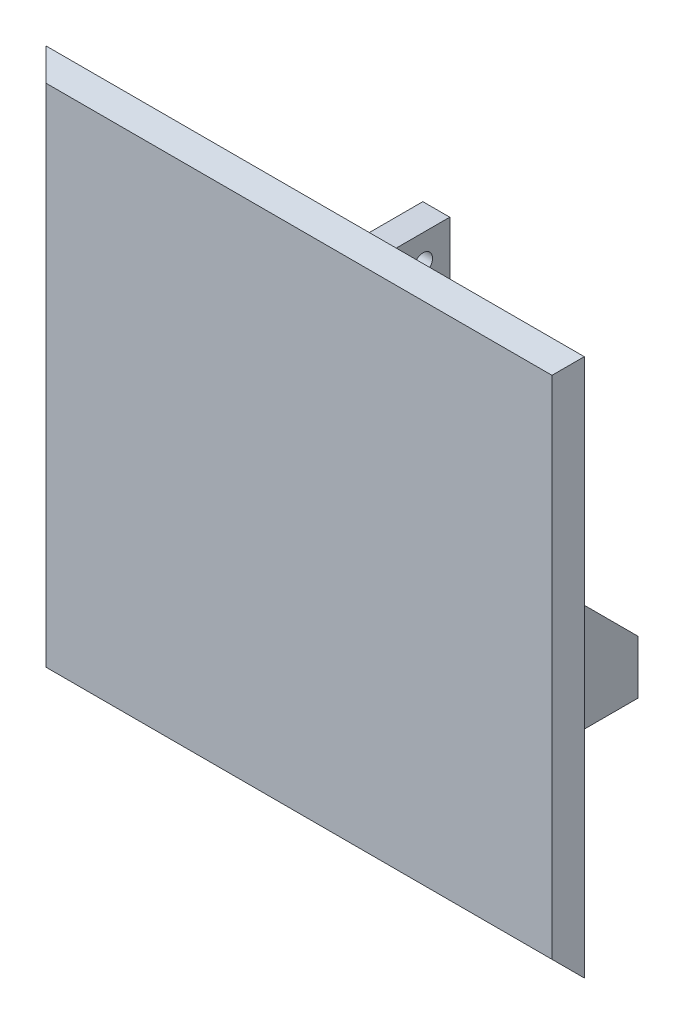
ISO-10303-21;
HEADER;
FILE_DESCRIPTION(('STEP AP214'),'2;1');
FILE_NAME('part.step','',(''),(''),'','','');
FILE_SCHEMA(('AUTOMOTIVE_DESIGN { 1 0 10303 214 1 1 1 1 }'));
ENDSEC;
DATA;
#1=APPLICATION_CONTEXT('core data for automotive mechanical design processes');
#2=APPLICATION_PROTOCOL_DEFINITION('international standard','automotive_design',2000,#1);
#3=PRODUCT_CONTEXT('',#1,'mechanical');
#4=PRODUCT('Part','Part','',(#3));
#5=PRODUCT_RELATED_PRODUCT_CATEGORY('part','',(#4));
#6=PRODUCT_DEFINITION_FORMATION('','',#4);
#7=PRODUCT_DEFINITION_CONTEXT('part definition',#1,'design');
#8=PRODUCT_DEFINITION('design','',#6,#7);
#9=PRODUCT_DEFINITION_SHAPE('','',#8);
#10=(LENGTH_UNIT() NAMED_UNIT(*) SI_UNIT(.MILLI.,.METRE.));
#11=(NAMED_UNIT(*) PLANE_ANGLE_UNIT() SI_UNIT($,.RADIAN.));
#12=(NAMED_UNIT(*) SI_UNIT($,.STERADIAN.) SOLID_ANGLE_UNIT());
#13=UNCERTAINTY_MEASURE_WITH_UNIT(LENGTH_MEASURE(1.E-05),#10,'distance_accuracy_value','');
#14=(GEOMETRIC_REPRESENTATION_CONTEXT(3) GLOBAL_UNCERTAINTY_ASSIGNED_CONTEXT((#13)) GLOBAL_UNIT_ASSIGNED_CONTEXT((#10,
#11,#12)) REPRESENTATION_CONTEXT('',''));
#15=CARTESIAN_POINT('',(0.,0.,0.));
#16=DIRECTION('',(0.,0.,1.));
#17=DIRECTION('',(1.,0.,0.));
#18=AXIS2_PLACEMENT_3D('',#15,#16,#17);
#19=CARTESIAN_POINT('',(0.,0.,3.));
#20=DIRECTION('',(0.,0.,-1.));
#21=DIRECTION('',(1.,0.,0.));
#22=AXIS2_PLACEMENT_3D('',#19,#20,#21);
#23=PLANE('',#22);
#24=DIRECTION('',(1.,0.,0.));
#25=VECTOR('',#24,1.);
#26=CARTESIAN_POINT('',(89.95,40.,3.));
#27=LINE('',#26,#25);
#28=CARTESIAN_POINT('',(89.95,40.,3.));
#29=VERTEX_POINT('',#28);
#30=CARTESIAN_POINT('',(99.95,40.,3.));
#31=VERTEX_POINT('',#30);
#32=EDGE_CURVE('E216',#29,#31,#27,.T.);
#33=ORIENTED_EDGE('',*,*,#32,.T.);
#34=DIRECTION('',(0.,1.,0.));
#35=VECTOR('',#34,1.);
#36=CARTESIAN_POINT('',(99.95,60.,3.));
#37=LINE('',#36,#35);
#38=CARTESIAN_POINT('',(99.95,60.,3.));
#39=VERTEX_POINT('',#38);
#40=EDGE_CURVE('E219',#31,#39,#37,.T.);
#41=ORIENTED_EDGE('',*,*,#40,.T.);
#42=DIRECTION('',(-1.,0.,0.));
#43=VECTOR('',#42,1.);
#44=CARTESIAN_POINT('',(89.95,60.,3.));
#45=LINE('',#44,#43);
#46=CARTESIAN_POINT('',(89.95,60.,3.));
#47=VERTEX_POINT('',#46);
#48=EDGE_CURVE('E206',#39,#47,#45,.T.);
#49=ORIENTED_EDGE('',*,*,#48,.T.);
#50=DIRECTION('',(0.,-1.,0.));
#51=VECTOR('',#50,1.);
#52=CARTESIAN_POINT('',(89.95,60.,3.));
#53=LINE('',#52,#51);
#54=EDGE_CURVE('E213',#47,#29,#53,.T.);
#55=ORIENTED_EDGE('',*,*,#54,.T.);
#56=EDGE_LOOP('',(#33,#41,#49,#55));
#57=FACE_BOUND('',#56,.T.);
#58=DIRECTION('',(0.,-1.,0.));
#59=VECTOR('',#58,1.);
#60=CARTESIAN_POINT('',(0.,100.,3.));
#61=LINE('',#60,#59);
#62=CARTESIAN_POINT('',(0.,100.,3.));
#63=VERTEX_POINT('',#62);
#64=CARTESIAN_POINT('',(0.,0.,3.));
#65=VERTEX_POINT('',#64);
#66=EDGE_CURVE('E252',#63,#65,#61,.T.);
#67=ORIENTED_EDGE('',*,*,#66,.F.);
#68=DIRECTION('',(-1.,0.,0.));
#69=VECTOR('',#68,1.);
#70=CARTESIAN_POINT('',(0.,100.,3.));
#71=LINE('',#70,#69);
#72=CARTESIAN_POINT('',(100.,100.,3.));
#73=VERTEX_POINT('',#72);
#74=EDGE_CURVE('E260',#73,#63,#71,.T.);
#75=ORIENTED_EDGE('',*,*,#74,.F.);
#76=DIRECTION('',(0.,1.,0.));
#77=VECTOR('',#76,1.);
#78=CARTESIAN_POINT('',(100.,100.,3.));
#79=LINE('',#78,#77);
#80=CARTESIAN_POINT('',(100.,0.,3.));
#81=VERTEX_POINT('',#80);
#82=EDGE_CURVE('E257',#81,#73,#79,.T.);
#83=ORIENTED_EDGE('',*,*,#82,.F.);
#84=DIRECTION('',(1.,0.,0.));
#85=VECTOR('',#84,1.);
#86=CARTESIAN_POINT('',(0.,0.,3.));
#87=LINE('',#86,#85);
#88=EDGE_CURVE('E255',#65,#81,#87,.T.);
#89=ORIENTED_EDGE('',*,*,#88,.F.);
#90=EDGE_LOOP('',(#67,#75,#83,#89));
#91=FACE_BOUND('',#90,.T.);
#92=DIRECTION('',(1.,0.,0.));
#93=VECTOR('',#92,1.);
#94=CARTESIAN_POINT('',(0.0499999999999819,40.,3.));
#95=LINE('',#94,#93);
#96=CARTESIAN_POINT('',(0.0499999999999819,40.,3.));
#97=VERTEX_POINT('',#96);
#98=CARTESIAN_POINT('',(10.05,40.,3.));
#99=VERTEX_POINT('',#98);
#100=EDGE_CURVE('E241',#97,#99,#95,.T.);
#101=ORIENTED_EDGE('',*,*,#100,.T.);
#102=DIRECTION('',(0.,1.,0.));
#103=VECTOR('',#102,1.);
#104=CARTESIAN_POINT('',(10.05,60.,3.));
#105=LINE('',#104,#103);
#106=CARTESIAN_POINT('',(10.05,60.,3.));
#107=VERTEX_POINT('',#106);
#108=EDGE_CURVE('E244',#99,#107,#105,.T.);
#109=ORIENTED_EDGE('',*,*,#108,.T.);
#110=DIRECTION('',(-1.,0.,0.));
#111=VECTOR('',#110,1.);
#112=CARTESIAN_POINT('',(0.0499999999999793,60.,3.));
#113=LINE('',#112,#111);
#114=CARTESIAN_POINT('',(0.0499999999999793,60.,3.));
#115=VERTEX_POINT('',#114);
#116=EDGE_CURVE('E232',#107,#115,#113,.T.);
#117=ORIENTED_EDGE('',*,*,#116,.T.);
#118=DIRECTION('',(0.,-1.,0.));
#119=VECTOR('',#118,1.);
#120=CARTESIAN_POINT('',(0.0499999999999793,60.,3.));
#121=LINE('',#120,#119);
#122=EDGE_CURVE('E227',#115,#97,#121,.T.);
#123=ORIENTED_EDGE('',*,*,#122,.T.);
#124=EDGE_LOOP('',(#101,#109,#117,#123));
#125=FACE_BOUND('',#124,.T.);
#126=DIRECTION('',(-1.,0.,0.));
#127=VECTOR('',#126,1.);
#128=CARTESIAN_POINT('',(65.,99.95,3.));
#129=LINE('',#128,#127);
#130=CARTESIAN_POINT('',(65.,99.95,3.));
#131=VERTEX_POINT('',#130);
#132=CARTESIAN_POINT('',(60.,99.95,3.));
#133=VERTEX_POINT('',#132);
#134=EDGE_CURVE('E166',#131,#133,#129,.T.);
#135=ORIENTED_EDGE('',*,*,#134,.T.);
#136=DIRECTION('',(0.,-1.,0.));
#137=VECTOR('',#136,1.);
#138=CARTESIAN_POINT('',(60.,99.95,3.));
#139=LINE('',#138,#137);
#140=CARTESIAN_POINT('',(60.,89.95,3.));
#141=VERTEX_POINT('',#140);
#142=EDGE_CURVE('E177',#133,#141,#139,.T.);
#143=ORIENTED_EDGE('',*,*,#142,.T.);
#144=DIRECTION('',(1.,0.,0.));
#145=VECTOR('',#144,1.);
#146=CARTESIAN_POINT('',(65.,89.95,3.));
#147=LINE('',#146,#145);
#148=CARTESIAN_POINT('',(65.,89.95,3.));
#149=VERTEX_POINT('',#148);
#150=EDGE_CURVE('E174',#141,#149,#147,.T.);
#151=ORIENTED_EDGE('',*,*,#150,.T.);
#152=DIRECTION('',(0.,1.,0.));
#153=VECTOR('',#152,1.);
#154=CARTESIAN_POINT('',(65.,99.95,3.));
#155=LINE('',#154,#153);
#156=EDGE_CURVE('E185',#149,#131,#155,.T.);
#157=ORIENTED_EDGE('',*,*,#156,.T.);
#158=EDGE_LOOP('',(#135,#143,#151,#157));
#159=FACE_BOUND('',#158,.T.);
#160=ADVANCED_FACE('F35',(#57,#91,#125,#159),#23,.T.);
#161=CARTESIAN_POINT('',(0.,0.,6.));
#162=DIRECTION('',(0.,0.,-1.));
#163=DIRECTION('',(1.,0.,0.));
#164=AXIS2_PLACEMENT_3D('',#161,#162,#163);
#165=PLANE('',#164);
#166=DIRECTION('',(0.,-1.,0.));
#167=VECTOR('',#166,1.);
#168=CARTESIAN_POINT('',(97.,0.,6.));
#169=LINE('',#168,#167);
#170=CARTESIAN_POINT('',(97.,97.,6.));
#171=VERTEX_POINT('',#170);
#172=CARTESIAN_POINT('',(97.,3.00000000000002,6.));
#173=VERTEX_POINT('',#172);
#174=EDGE_CURVE('E44',#171,#173,#169,.T.);
#175=ORIENTED_EDGE('',*,*,#174,.F.);
#176=DIRECTION('',(1.,0.,0.));
#177=VECTOR('',#176,1.);
#178=CARTESIAN_POINT('',(0.,97.,6.));
#179=LINE('',#178,#177);
#180=CARTESIAN_POINT('',(3.,97.,6.));
#181=VERTEX_POINT('',#180);
#182=EDGE_CURVE('E284',#181,#171,#179,.T.);
#183=ORIENTED_EDGE('',*,*,#182,.F.);
#184=DIRECTION('',(0.,1.,0.));
#185=VECTOR('',#184,1.);
#186=CARTESIAN_POINT('',(3.00000000000002,0.,6.));
#187=LINE('',#186,#185);
#188=CARTESIAN_POINT('',(3.00000000000002,3.00000000000002,6.));
#189=VERTEX_POINT('',#188);
#190=EDGE_CURVE('E277',#189,#181,#187,.T.);
#191=ORIENTED_EDGE('',*,*,#190,.F.);
#192=DIRECTION('',(-1.,0.,0.));
#193=VECTOR('',#192,1.);
#194=CARTESIAN_POINT('',(0.,3.00000000000002,6.));
#195=LINE('',#194,#193);
#196=EDGE_CURVE('E11',#173,#189,#195,.T.);
#197=ORIENTED_EDGE('',*,*,#196,.F.);
#198=EDGE_LOOP('',(#175,#183,#191,#197));
#199=FACE_BOUND('',#198,.T.);
#200=ADVANCED_FACE('F302',(#199),#165,.F.);
#201=CARTESIAN_POINT('',(0.0499999999999793,60.,-7.));
#202=DIRECTION('',(1.,0.,0.));
#203=DIRECTION('',(0.,1.,0.));
#204=AXIS2_PLACEMENT_3D('',#201,#202,#203);
#205=PLANE('',#204);
#206=DIRECTION('',(0.,-1.,0.));
#207=VECTOR('',#206,1.);
#208=CARTESIAN_POINT('',(0.0499999999999793,60.,-7.));
#209=LINE('',#208,#207);
#210=CARTESIAN_POINT('',(0.0499999999999806,50.,-7.));
#211=VERTEX_POINT('',#210);
#212=CARTESIAN_POINT('',(0.0499999999999819,40.,-7.));
#213=VERTEX_POINT('',#212);
#214=EDGE_CURVE('E228',#211,#213,#209,.T.);
#215=ORIENTED_EDGE('',*,*,#214,.T.);
#216=DIRECTION('',(0.,0.,1.));
#217=VECTOR('',#216,1.);
#218=CARTESIAN_POINT('',(0.0499999999999819,40.,-7.));
#219=LINE('',#218,#217);
#220=EDGE_CURVE('E250',#213,#97,#219,.T.);
#221=ORIENTED_EDGE('',*,*,#220,.T.);
#222=ORIENTED_EDGE('',*,*,#122,.F.);
#223=DIRECTION('',(0.,0.707106781186547,0.707106781186549));
#224=VECTOR('',#223,1.);
#225=CARTESIAN_POINT('',(0.0499999999999806,50.,-7.));
#226=LINE('',#225,#224);
#227=EDGE_CURVE('E272',#211,#115,#226,.T.);
#228=ORIENTED_EDGE('',*,*,#227,.F.);
#229=EDGE_LOOP('',(#215,#221,#222,#228));
#230=FACE_BOUND('',#229,.T.);
#231=ADVANCED_FACE('F326',(#230),#205,.F.);
#232=CARTESIAN_POINT('',(0.0499999999999819,40.,-7.));
#233=DIRECTION('',(0.,1.,0.));
#234=DIRECTION('',(0.,0.,-1.));
#235=AXIS2_PLACEMENT_3D('',#232,#233,#234);
#236=PLANE('',#235);
#237=CARTESIAN_POINT('',(5.04622786455411,40.,-2.));
#238=DIRECTION('',(0.,1.,0.));
#239=DIRECTION('',(0.,0.,1.));
#240=AXIS2_PLACEMENT_3D('',#237,#238,#239);
#241=CIRCLE('',#240,1.525);
#242=CARTESIAN_POINT('',(5.04622786455411,40.,-0.474999999999999));
#243=VERTEX_POINT('',#242);
#244=EDGE_CURVE('E198',#243,#243,#241,.T.);
#245=ORIENTED_EDGE('',*,*,#244,.T.);
#246=EDGE_LOOP('',(#245));
#247=FACE_BOUND('',#246,.T.);
#248=ORIENTED_EDGE('',*,*,#100,.F.);
#249=ORIENTED_EDGE('',*,*,#220,.F.);
#250=DIRECTION('',(1.,0.,0.));
#251=VECTOR('',#250,1.);
#252=CARTESIAN_POINT('',(0.0499999999999819,40.,-7.));
#253=LINE('',#252,#251);
#254=CARTESIAN_POINT('',(10.05,40.,-7.));
#255=VERTEX_POINT('',#254);
#256=EDGE_CURVE('E231',#213,#255,#253,.T.);
#257=ORIENTED_EDGE('',*,*,#256,.T.);
#258=DIRECTION('',(0.,0.,1.));
#259=VECTOR('',#258,1.);
#260=CARTESIAN_POINT('',(10.05,40.,-7.));
#261=LINE('',#260,#259);
#262=EDGE_CURVE('E238',#255,#99,#261,.T.);
#263=ORIENTED_EDGE('',*,*,#262,.T.);
#264=EDGE_LOOP('',(#248,#249,#257,#263));
#265=FACE_BOUND('',#264,.T.);
#266=ADVANCED_FACE('F362',(#247,#265),#236,.F.);
#267=CARTESIAN_POINT('',(10.05,60.,-7.));
#268=DIRECTION('',(-1.,0.,0.));
#269=DIRECTION('',(0.,0.,-1.));
#270=AXIS2_PLACEMENT_3D('',#267,#268,#269);
#271=PLANE('',#270);
#272=ORIENTED_EDGE('',*,*,#108,.F.);
#273=ORIENTED_EDGE('',*,*,#262,.F.);
#274=DIRECTION('',(0.,1.,0.));
#275=VECTOR('',#274,1.);
#276=CARTESIAN_POINT('',(10.05,60.,-7.));
#277=LINE('',#276,#275);
#278=CARTESIAN_POINT('',(10.05,50.,-7.));
#279=VERTEX_POINT('',#278);
#280=EDGE_CURVE('E235',#255,#279,#277,.T.);
#281=ORIENTED_EDGE('',*,*,#280,.T.);
#282=DIRECTION('',(0.,-0.707106781186547,-0.707106781186549));
#283=VECTOR('',#282,1.);
#284=CARTESIAN_POINT('',(10.05,50.,-7.));
#285=LINE('',#284,#283);
#286=EDGE_CURVE('E274',#107,#279,#285,.T.);
#287=ORIENTED_EDGE('',*,*,#286,.F.);
#288=EDGE_LOOP('',(#272,#273,#281,#287));
#289=FACE_BOUND('',#288,.T.);
#290=ADVANCED_FACE('F352',(#289),#271,.F.);
#291=CARTESIAN_POINT('',(0.,0.,-7.));
#292=DIRECTION('',(0.,0.,-1.));
#293=DIRECTION('',(1.,0.,0.));
#294=AXIS2_PLACEMENT_3D('',#291,#292,#293);
#295=PLANE('',#294);
#296=ORIENTED_EDGE('',*,*,#280,.F.);
#297=ORIENTED_EDGE('',*,*,#256,.F.);
#298=ORIENTED_EDGE('',*,*,#214,.F.);
#299=DIRECTION('',(-1.,0.,0.));
#300=VECTOR('',#299,1.);
#301=CARTESIAN_POINT('',(0.0499999999999793,50.,-7.));
#302=LINE('',#301,#300);
#303=EDGE_CURVE('E270',#279,#211,#302,.T.);
#304=ORIENTED_EDGE('',*,*,#303,.F.);
#305=EDGE_LOOP('',(#296,#297,#298,#304));
#306=FACE_BOUND('',#305,.T.);
#307=ADVANCED_FACE('F354',(#306),#295,.T.);
#308=CARTESIAN_POINT('',(89.95,60.,-7.));
#309=DIRECTION('',(1.,0.,0.));
#310=DIRECTION('',(0.,1.,0.));
#311=AXIS2_PLACEMENT_3D('',#308,#309,#310);
#312=PLANE('',#311);
#313=DIRECTION('',(0.,-1.,0.));
#314=VECTOR('',#313,1.);
#315=CARTESIAN_POINT('',(89.95,60.,-7.));
#316=LINE('',#315,#314);
#317=CARTESIAN_POINT('',(89.95,50.,-7.));
#318=VERTEX_POINT('',#317);
#319=CARTESIAN_POINT('',(89.95,40.,-7.));
#320=VERTEX_POINT('',#319);
#321=EDGE_CURVE('E202',#318,#320,#316,.T.);
#322=ORIENTED_EDGE('',*,*,#321,.T.);
#323=DIRECTION('',(0.,0.,1.));
#324=VECTOR('',#323,1.);
#325=CARTESIAN_POINT('',(89.95,40.,-7.));
#326=LINE('',#325,#324);
#327=EDGE_CURVE('E225',#320,#29,#326,.T.);
#328=ORIENTED_EDGE('',*,*,#327,.T.);
#329=ORIENTED_EDGE('',*,*,#54,.F.);
#330=DIRECTION('',(0.,0.707106781186547,0.707106781186549));
#331=VECTOR('',#330,1.);
#332=CARTESIAN_POINT('',(89.95,50.,-7.00000000000003));
#333=LINE('',#332,#331);
#334=EDGE_CURVE('E265',#318,#47,#333,.T.);
#335=ORIENTED_EDGE('',*,*,#334,.F.);
#336=EDGE_LOOP('',(#322,#328,#329,#335));
#337=FACE_BOUND('',#336,.T.);
#338=ADVANCED_FACE('F373',(#337),#312,.F.);
#339=CARTESIAN_POINT('',(89.95,40.,-7.));
#340=DIRECTION('',(0.,1.,0.));
#341=DIRECTION('',(0.,0.,-1.));
#342=AXIS2_PLACEMENT_3D('',#339,#340,#341);
#343=PLANE('',#342);
#344=CARTESIAN_POINT('',(94.95,40.,-2.));
#345=DIRECTION('',(0.,1.,0.));
#346=DIRECTION('',(0.,0.,1.));
#347=AXIS2_PLACEMENT_3D('',#344,#345,#346);
#348=CIRCLE('',#347,1.525);
#349=CARTESIAN_POINT('',(94.95,40.,-0.475000000000004));
#350=VERTEX_POINT('',#349);
#351=EDGE_CURVE('E193',#350,#350,#348,.T.);
#352=ORIENTED_EDGE('',*,*,#351,.T.);
#353=EDGE_LOOP('',(#352));
#354=FACE_BOUND('',#353,.T.);
#355=ORIENTED_EDGE('',*,*,#32,.F.);
#356=ORIENTED_EDGE('',*,*,#327,.F.);
#357=DIRECTION('',(1.,0.,0.));
#358=VECTOR('',#357,1.);
#359=CARTESIAN_POINT('',(89.95,40.,-7.));
#360=LINE('',#359,#358);
#361=CARTESIAN_POINT('',(99.95,40.,-7.));
#362=VERTEX_POINT('',#361);
#363=EDGE_CURVE('E205',#320,#362,#360,.T.);
#364=ORIENTED_EDGE('',*,*,#363,.T.);
#365=DIRECTION('',(0.,0.,1.));
#366=VECTOR('',#365,1.);
#367=CARTESIAN_POINT('',(99.95,40.,-7.));
#368=LINE('',#367,#366);
#369=EDGE_CURVE('E212',#362,#31,#368,.T.);
#370=ORIENTED_EDGE('',*,*,#369,.T.);
#371=EDGE_LOOP('',(#355,#356,#364,#370));
#372=FACE_BOUND('',#371,.T.);
#373=ADVANCED_FACE('F376',(#354,#372),#343,.F.);
#374=CARTESIAN_POINT('',(99.95,60.,-7.));
#375=DIRECTION('',(-1.,0.,0.));
#376=DIRECTION('',(0.,0.,-1.));
#377=AXIS2_PLACEMENT_3D('',#374,#375,#376);
#378=PLANE('',#377);
#379=ORIENTED_EDGE('',*,*,#40,.F.);
#380=ORIENTED_EDGE('',*,*,#369,.F.);
#381=DIRECTION('',(0.,1.,0.));
#382=VECTOR('',#381,1.);
#383=CARTESIAN_POINT('',(99.95,60.,-7.));
#384=LINE('',#383,#382);
#385=CARTESIAN_POINT('',(99.95,50.,-7.));
#386=VERTEX_POINT('',#385);
#387=EDGE_CURVE('E209',#362,#386,#384,.T.);
#388=ORIENTED_EDGE('',*,*,#387,.T.);
#389=DIRECTION('',(0.,-0.707106781186547,-0.707106781186549));
#390=VECTOR('',#389,1.);
#391=CARTESIAN_POINT('',(99.95,50.,-7.));
#392=LINE('',#391,#390);
#393=EDGE_CURVE('E267',#39,#386,#392,.T.);
#394=ORIENTED_EDGE('',*,*,#393,.F.);
#395=EDGE_LOOP('',(#379,#380,#388,#394));
#396=FACE_BOUND('',#395,.T.);
#397=ADVANCED_FACE('F380',(#396),#378,.F.);
#398=CARTESIAN_POINT('',(0.,0.,-7.));
#399=DIRECTION('',(0.,0.,-1.));
#400=DIRECTION('',(1.,0.,0.));
#401=AXIS2_PLACEMENT_3D('',#398,#399,#400);
#402=PLANE('',#401);
#403=ORIENTED_EDGE('',*,*,#387,.F.);
#404=ORIENTED_EDGE('',*,*,#363,.F.);
#405=ORIENTED_EDGE('',*,*,#321,.F.);
#406=DIRECTION('',(-1.,0.,0.));
#407=VECTOR('',#406,1.);
#408=CARTESIAN_POINT('',(89.95,50.,-7.));
#409=LINE('',#408,#407);
#410=EDGE_CURVE('E263',#386,#318,#409,.T.);
#411=ORIENTED_EDGE('',*,*,#410,.F.);
#412=EDGE_LOOP('',(#403,#404,#405,#411));
#413=FACE_BOUND('',#412,.T.);
#414=ADVANCED_FACE('F334',(#413),#402,.T.);
#415=CARTESIAN_POINT('',(0.,50.,-7.));
#416=DIRECTION('',(0.,0.707106781186548,-0.707106781186546));
#417=DIRECTION('',(1.,0.,0.));
#418=AXIS2_PLACEMENT_3D('',#415,#416,#417);
#419=PLANE('',#418);
#420=CARTESIAN_POINT('',(94.95,55.,-2.));
#421=DIRECTION('',(0.,-0.707106781186548,0.707106781186546));
#422=DIRECTION('',(0.,-0.707106781186547,-0.707106781186549));
#423=AXIS2_PLACEMENT_3D('',#420,#421,#422);
#424=ELLIPSE('',#423,2.15667568261896,1.525);
#425=CARTESIAN_POINT('',(94.95,53.475,-3.525));
#426=VERTEX_POINT('',#425);
#427=EDGE_CURVE('E196',#426,#426,#424,.T.);
#428=ORIENTED_EDGE('',*,*,#427,.T.);
#429=EDGE_LOOP('',(#428));
#430=FACE_BOUND('',#429,.T.);
#431=ORIENTED_EDGE('',*,*,#393,.T.);
#432=ORIENTED_EDGE('',*,*,#410,.T.);
#433=ORIENTED_EDGE('',*,*,#334,.T.);
#434=ORIENTED_EDGE('',*,*,#48,.F.);
#435=EDGE_LOOP('',(#431,#432,#433,#434));
#436=FACE_BOUND('',#435,.T.);
#437=ADVANCED_FACE('F331',(#430,#436),#419,.T.);
#438=CARTESIAN_POINT('',(0.,50.,-7.));
#439=DIRECTION('',(0.,0.707106781186548,-0.707106781186546));
#440=DIRECTION('',(1.,0.,0.));
#441=AXIS2_PLACEMENT_3D('',#438,#439,#440);
#442=PLANE('',#441);
#443=CARTESIAN_POINT('',(5.04622786455411,55.,-2.));
#444=DIRECTION('',(0.,-0.707106781186548,0.707106781186546));
#445=DIRECTION('',(0.,-0.707106781186547,-0.707106781186549));
#446=AXIS2_PLACEMENT_3D('',#443,#444,#445);
#447=ELLIPSE('',#446,2.15667568261897,1.525);
#448=CARTESIAN_POINT('',(5.04622786455411,53.475,-3.525));
#449=VERTEX_POINT('',#448);
#450=EDGE_CURVE('E201',#449,#449,#447,.T.);
#451=ORIENTED_EDGE('',*,*,#450,.T.);
#452=EDGE_LOOP('',(#451));
#453=FACE_BOUND('',#452,.T.);
#454=ORIENTED_EDGE('',*,*,#286,.T.);
#455=ORIENTED_EDGE('',*,*,#303,.T.);
#456=ORIENTED_EDGE('',*,*,#227,.T.);
#457=ORIENTED_EDGE('',*,*,#116,.F.);
#458=EDGE_LOOP('',(#454,#455,#456,#457));
#459=FACE_BOUND('',#458,.T.);
#460=ADVANCED_FACE('F333',(#453,#459),#442,.T.);
#461=CARTESIAN_POINT('',(5.04622786455411,100.,-2.));
#462=DIRECTION('',(0.,-1.,0.));
#463=DIRECTION('',(0.,0.,1.));
#464=AXIS2_PLACEMENT_3D('',#461,#462,#463);
#465=CYLINDRICAL_SURFACE('',#464,1.525);
#466=ORIENTED_EDGE('',*,*,#450,.F.);
#467=EDGE_LOOP('',(#466));
#468=FACE_BOUND('',#467,.T.);
#469=ORIENTED_EDGE('',*,*,#244,.F.);
#470=EDGE_LOOP('',(#469));
#471=FACE_BOUND('',#470,.T.);
#472=ADVANCED_FACE('F337',(#468,#471),#465,.F.);
#473=CARTESIAN_POINT('',(94.95,100.,-2.));
#474=DIRECTION('',(0.,-1.,0.));
#475=DIRECTION('',(0.,0.,1.));
#476=AXIS2_PLACEMENT_3D('',#473,#474,#475);
#477=CYLINDRICAL_SURFACE('',#476,1.525);
#478=ORIENTED_EDGE('',*,*,#427,.F.);
#479=EDGE_LOOP('',(#478));
#480=FACE_BOUND('',#479,.T.);
#481=ORIENTED_EDGE('',*,*,#351,.F.);
#482=EDGE_LOOP('',(#481));
#483=FACE_BOUND('',#482,.T.);
#484=ADVANCED_FACE('F342',(#480,#483),#477,.F.);
#485=CARTESIAN_POINT('',(0.,100.,3.));
#486=DIRECTION('',(0.,-0.707106781186546,-0.707106781186549));
#487=DIRECTION('',(-1.,0.,0.));
#488=AXIS2_PLACEMENT_3D('',#485,#486,#487);
#489=PLANE('',#488);
#490=DIRECTION('',(-0.577350269189627,-0.577350269189627,0.577350269189624));
#491=VECTOR('',#490,1.);
#492=CARTESIAN_POINT('',(66.6666666666666,66.6666666666666,36.3333333333333));
#493=LINE('',#492,#491);
#494=EDGE_CURVE('E292',#171,#73,#493,.F.);
#495=ORIENTED_EDGE('',*,*,#494,.T.);
#496=ORIENTED_EDGE('',*,*,#74,.T.);
#497=DIRECTION('',(0.577350269189627,-0.577350269189627,0.577350269189624));
#498=VECTOR('',#497,1.);
#499=CARTESIAN_POINT('',(0.,100.,3.));
#500=LINE('',#499,#498);
#501=EDGE_CURVE('E197',#63,#181,#500,.T.);
#502=ORIENTED_EDGE('',*,*,#501,.T.);
#503=ORIENTED_EDGE('',*,*,#182,.T.);
#504=EDGE_LOOP('',(#495,#496,#502,#503));
#505=FACE_BOUND('',#504,.T.);
#506=ADVANCED_FACE('F37',(#505),#489,.F.);
#507=CARTESIAN_POINT('',(0.,100.,3.));
#508=DIRECTION('',(0.707106781186546,0.,-0.707106781186549));
#509=DIRECTION('',(0.,-1.,0.));
#510=AXIS2_PLACEMENT_3D('',#507,#508,#509);
#511=PLANE('',#510);
#512=ORIENTED_EDGE('',*,*,#501,.F.);
#513=ORIENTED_EDGE('',*,*,#66,.T.);
#514=DIRECTION('',(-0.577350269189627,-0.577350269189627,-0.577350269189624));
#515=VECTOR('',#514,1.);
#516=CARTESIAN_POINT('',(33.3333333333334,33.3333333333334,36.3333333333333));
#517=LINE('',#516,#515);
#518=EDGE_CURVE('E290',#65,#189,#517,.F.);
#519=ORIENTED_EDGE('',*,*,#518,.T.);
#520=ORIENTED_EDGE('',*,*,#190,.T.);
#521=EDGE_LOOP('',(#512,#513,#519,#520));
#522=FACE_BOUND('',#521,.T.);
#523=ADVANCED_FACE('F300',(#522),#511,.F.);
#524=CARTESIAN_POINT('',(100.,100.,3.));
#525=DIRECTION('',(-0.707106781186546,0.,-0.707106781186549));
#526=DIRECTION('',(0.,1.,0.));
#527=AXIS2_PLACEMENT_3D('',#524,#525,#526);
#528=PLANE('',#527);
#529=ORIENTED_EDGE('',*,*,#494,.F.);
#530=ORIENTED_EDGE('',*,*,#174,.T.);
#531=DIRECTION('',(-0.577350269189627,0.577350269189627,0.577350269189624));
#532=VECTOR('',#531,1.);
#533=CARTESIAN_POINT('',(66.6666666666666,33.3333333333334,36.3333333333333));
#534=LINE('',#533,#532);
#535=EDGE_CURVE('E59',#173,#81,#534,.F.);
#536=ORIENTED_EDGE('',*,*,#535,.T.);
#537=ORIENTED_EDGE('',*,*,#82,.T.);
#538=EDGE_LOOP('',(#529,#530,#536,#537));
#539=FACE_BOUND('',#538,.T.);
#540=ADVANCED_FACE('F304',(#539),#528,.F.);
#541=CARTESIAN_POINT('',(0.,0.,3.));
#542=DIRECTION('',(0.,0.707106781186546,-0.707106781186549));
#543=DIRECTION('',(1.,0.,0.));
#544=AXIS2_PLACEMENT_3D('',#541,#542,#543);
#545=PLANE('',#544);
#546=ORIENTED_EDGE('',*,*,#518,.F.);
#547=ORIENTED_EDGE('',*,*,#88,.T.);
#548=ORIENTED_EDGE('',*,*,#535,.F.);
#549=ORIENTED_EDGE('',*,*,#196,.T.);
#550=EDGE_LOOP('',(#546,#547,#548,#549));
#551=FACE_BOUND('',#550,.T.);
#552=ADVANCED_FACE('F309',(#551),#545,.F.);
#553=CARTESIAN_POINT('',(65.,99.95,-7.));
#554=DIRECTION('',(-1.,0.,0.));
#555=DIRECTION('',(0.,0.,-1.));
#556=AXIS2_PLACEMENT_3D('',#553,#554,#555);
#557=PLANE('',#556);
#558=CARTESIAN_POINT('',(65.,94.95,-2.05));
#559=DIRECTION('',(-1.,0.,0.));
#560=DIRECTION('',(0.,0.,1.));
#561=AXIS2_PLACEMENT_3D('',#558,#559,#560);
#562=CIRCLE('',#561,1.75);
#563=CARTESIAN_POINT('',(65.,94.95,-0.299999999999999));
#564=VERTEX_POINT('',#563);
#565=EDGE_CURVE('E180',#564,#564,#562,.T.);
#566=ORIENTED_EDGE('',*,*,#565,.T.);
#567=EDGE_LOOP('',(#566));
#568=FACE_BOUND('',#567,.T.);
#569=ORIENTED_EDGE('',*,*,#156,.F.);
#570=DIRECTION('',(0.,0.,1.));
#571=VECTOR('',#570,1.);
#572=CARTESIAN_POINT('',(65.,89.95,-7.));
#573=LINE('',#572,#571);
#574=CARTESIAN_POINT('',(65.,89.95,-7.));
#575=VERTEX_POINT('',#574);
#576=EDGE_CURVE('E173',#575,#149,#573,.T.);
#577=ORIENTED_EDGE('',*,*,#576,.F.);
#578=DIRECTION('',(0.,1.,0.));
#579=VECTOR('',#578,1.);
#580=CARTESIAN_POINT('',(65.,99.95,-7.));
#581=LINE('',#580,#579);
#582=CARTESIAN_POINT('',(65.,99.95,-7.));
#583=VERTEX_POINT('',#582);
#584=EDGE_CURVE('E156',#575,#583,#581,.T.);
#585=ORIENTED_EDGE('',*,*,#584,.T.);
#586=DIRECTION('',(0.,0.,1.));
#587=VECTOR('',#586,1.);
#588=CARTESIAN_POINT('',(65.,99.95,-7.));
#589=LINE('',#588,#587);
#590=EDGE_CURVE('E163',#583,#131,#589,.T.);
#591=ORIENTED_EDGE('',*,*,#590,.T.);
#592=EDGE_LOOP('',(#569,#577,#585,#591));
#593=FACE_BOUND('',#592,.T.);
#594=ADVANCED_FACE('F172',(#568,#593),#557,.F.);
#595=CARTESIAN_POINT('',(65.,99.95,-7.));
#596=DIRECTION('',(0.,-1.,0.));
#597=DIRECTION('',(0.,0.,1.));
#598=AXIS2_PLACEMENT_3D('',#595,#596,#597);
#599=PLANE('',#598);
#600=ORIENTED_EDGE('',*,*,#134,.F.);
#601=ORIENTED_EDGE('',*,*,#590,.F.);
#602=DIRECTION('',(-1.,0.,0.));
#603=VECTOR('',#602,1.);
#604=CARTESIAN_POINT('',(65.,99.95,-7.));
#605=LINE('',#604,#603);
#606=CARTESIAN_POINT('',(60.,99.95,-7.));
#607=VERTEX_POINT('',#606);
#608=EDGE_CURVE('E152',#583,#607,#605,.T.);
#609=ORIENTED_EDGE('',*,*,#608,.T.);
#610=DIRECTION('',(0.,0.,1.));
#611=VECTOR('',#610,1.);
#612=CARTESIAN_POINT('',(60.,99.95,-7.));
#613=LINE('',#612,#611);
#614=EDGE_CURVE('E170',#607,#133,#613,.T.);
#615=ORIENTED_EDGE('',*,*,#614,.T.);
#616=EDGE_LOOP('',(#600,#601,#609,#615));
#617=FACE_BOUND('',#616,.T.);
#618=ADVANCED_FACE('F164',(#617),#599,.F.);
#619=CARTESIAN_POINT('',(60.,99.95,-7.));
#620=DIRECTION('',(1.,0.,0.));
#621=DIRECTION('',(0.,1.,0.));
#622=AXIS2_PLACEMENT_3D('',#619,#620,#621);
#623=PLANE('',#622);
#624=CARTESIAN_POINT('',(60.,94.95,-2.05));
#625=DIRECTION('',(-1.,0.,0.));
#626=DIRECTION('',(0.,1.,0.));
#627=AXIS2_PLACEMENT_3D('',#624,#625,#626);
#628=CIRCLE('',#627,1.75);
#629=CARTESIAN_POINT('',(60.,96.7,-2.05));
#630=VERTEX_POINT('',#629);
#631=EDGE_CURVE('E39',#630,#630,#628,.T.);
#632=ORIENTED_EDGE('',*,*,#631,.F.);
#633=EDGE_LOOP('',(#632));
#634=FACE_BOUND('',#633,.T.);
#635=ORIENTED_EDGE('',*,*,#142,.F.);
#636=ORIENTED_EDGE('',*,*,#614,.F.);
#637=DIRECTION('',(0.,-1.,0.));
#638=VECTOR('',#637,1.);
#639=CARTESIAN_POINT('',(60.,99.95,-7.));
#640=LINE('',#639,#638);
#641=CARTESIAN_POINT('',(60.,89.95,-7.));
#642=VERTEX_POINT('',#641);
#643=EDGE_CURVE('E158',#607,#642,#640,.T.);
#644=ORIENTED_EDGE('',*,*,#643,.T.);
#645=DIRECTION('',(0.,0.,1.));
#646=VECTOR('',#645,1.);
#647=CARTESIAN_POINT('',(60.,89.95,-7.));
#648=LINE('',#647,#646);
#649=EDGE_CURVE('E52',#642,#141,#648,.T.);
#650=ORIENTED_EDGE('',*,*,#649,.T.);
#651=EDGE_LOOP('',(#635,#636,#644,#650));
#652=FACE_BOUND('',#651,.T.);
#653=ADVANCED_FACE('F393',(#634,#652),#623,.F.);
#654=CARTESIAN_POINT('',(65.,89.95,-7.));
#655=DIRECTION('',(0.,1.,0.));
#656=DIRECTION('',(-1.,0.,0.));
#657=AXIS2_PLACEMENT_3D('',#654,#655,#656);
#658=PLANE('',#657);
#659=ORIENTED_EDGE('',*,*,#150,.F.);
#660=ORIENTED_EDGE('',*,*,#649,.F.);
#661=DIRECTION('',(1.,0.,0.));
#662=VECTOR('',#661,1.);
#663=CARTESIAN_POINT('',(65.,89.95,-7.));
#664=LINE('',#663,#662);
#665=EDGE_CURVE('E183',#642,#575,#664,.T.);
#666=ORIENTED_EDGE('',*,*,#665,.T.);
#667=ORIENTED_EDGE('',*,*,#576,.T.);
#668=EDGE_LOOP('',(#659,#660,#666,#667));
#669=FACE_BOUND('',#668,.T.);
#670=ADVANCED_FACE('F396',(#669),#658,.F.);
#671=CARTESIAN_POINT('',(0.,0.,-7.));
#672=DIRECTION('',(0.,0.,1.));
#673=DIRECTION('',(-1.,0.,0.));
#674=AXIS2_PLACEMENT_3D('',#671,#672,#673);
#675=PLANE('',#674);
#676=ORIENTED_EDGE('',*,*,#584,.F.);
#677=ORIENTED_EDGE('',*,*,#665,.F.);
#678=ORIENTED_EDGE('',*,*,#643,.F.);
#679=ORIENTED_EDGE('',*,*,#608,.F.);
#680=EDGE_LOOP('',(#676,#677,#678,#679));
#681=FACE_BOUND('',#680,.T.);
#682=ADVANCED_FACE('F154',(#681),#675,.F.);
#683=CARTESIAN_POINT('',(55.,94.95,-2.05));
#684=DIRECTION('',(1.,0.,0.));
#685=DIRECTION('',(0.,0.,1.));
#686=AXIS2_PLACEMENT_3D('',#683,#684,#685);
#687=CYLINDRICAL_SURFACE('',#686,1.75);
#688=ORIENTED_EDGE('',*,*,#565,.F.);
#689=EDGE_LOOP('',(#688));
#690=FACE_BOUND('',#689,.T.);
#691=ORIENTED_EDGE('',*,*,#631,.T.);
#692=EDGE_LOOP('',(#691));
#693=FACE_BOUND('',#692,.T.);
#694=ADVANCED_FACE('F403',(#690,#693),#687,.F.);
#695=CLOSED_SHELL('',(#160,#200,#231,#266,#290,#307,#338,#373,#397,#414,#437,#460,#472,#484,
#506,#523,#540,#552,#594,#618,#653,#670,#682,#694));
#696=MANIFOLD_SOLID_BREP('B2',#695);
#697=ADVANCED_BREP_SHAPE_REPRESENTATION('',(#18,#696),#14);
#698=SHAPE_DEFINITION_REPRESENTATION(#9,#697);
ENDSEC;
END-ISO-10303-21;
